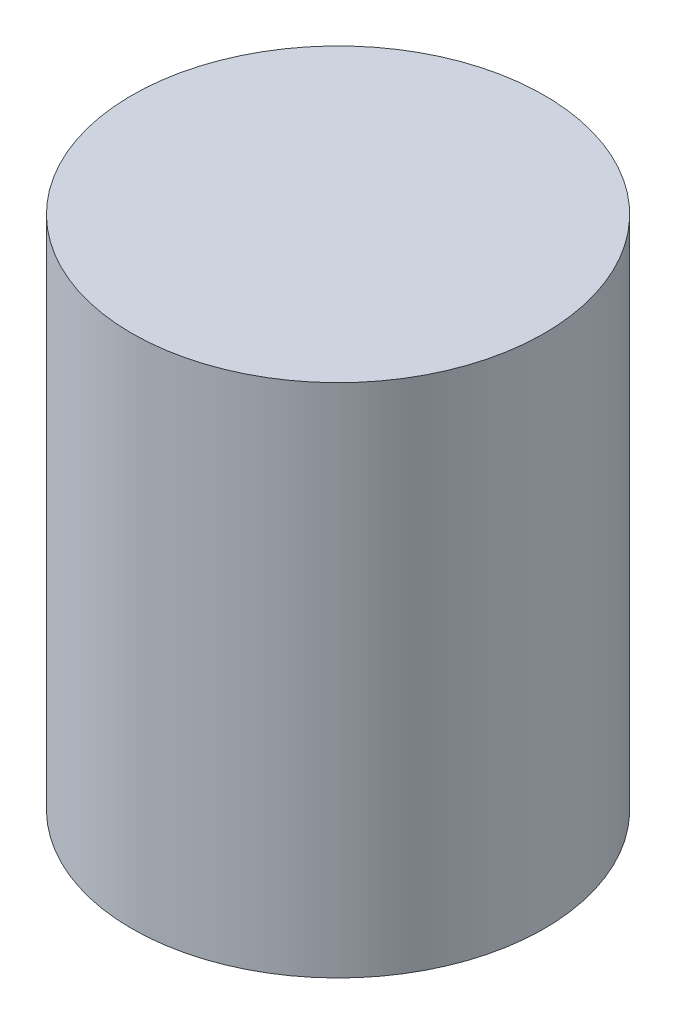
ISO-10303-21;
HEADER;
FILE_DESCRIPTION(('STEP AP214'),'2;1');
FILE_NAME('part.step','',(''),(''),'','','');
FILE_SCHEMA(('AUTOMOTIVE_DESIGN { 1 0 10303 214 1 1 1 1 }'));
ENDSEC;
DATA;
#1=APPLICATION_CONTEXT('core data for automotive mechanical design processes');
#2=APPLICATION_PROTOCOL_DEFINITION('international standard','automotive_design',2000,#1);
#3=PRODUCT_CONTEXT('',#1,'mechanical');
#4=PRODUCT('Part','Part','',(#3));
#5=PRODUCT_RELATED_PRODUCT_CATEGORY('part','',(#4));
#6=PRODUCT_DEFINITION_FORMATION('','',#4);
#7=PRODUCT_DEFINITION_CONTEXT('part definition',#1,'design');
#8=PRODUCT_DEFINITION('design','',#6,#7);
#9=PRODUCT_DEFINITION_SHAPE('','',#8);
#10=(LENGTH_UNIT() NAMED_UNIT(*) SI_UNIT(.MILLI.,.METRE.));
#11=(NAMED_UNIT(*) PLANE_ANGLE_UNIT() SI_UNIT($,.RADIAN.));
#12=(NAMED_UNIT(*) SI_UNIT($,.STERADIAN.) SOLID_ANGLE_UNIT());
#13=UNCERTAINTY_MEASURE_WITH_UNIT(LENGTH_MEASURE(1.E-05),#10,'distance_accuracy_value','');
#14=(GEOMETRIC_REPRESENTATION_CONTEXT(3) GLOBAL_UNCERTAINTY_ASSIGNED_CONTEXT((#13)) GLOBAL_UNIT_ASSIGNED_CONTEXT((#10,
#11,#12)) REPRESENTATION_CONTEXT('',''));
#15=CARTESIAN_POINT('',(0.,0.,0.));
#16=DIRECTION('',(0.,0.,1.));
#17=DIRECTION('',(1.,0.,0.));
#18=AXIS2_PLACEMENT_3D('',#15,#16,#17);
#19=CARTESIAN_POINT('',(0.,5.,0.));
#20=DIRECTION('',(0.,-1.,0.));
#21=DIRECTION('',(0.,0.,-1.));
#22=AXIS2_PLACEMENT_3D('',#19,#20,#21);
#23=CYLINDRICAL_SURFACE('',#22,4.);
#24=CARTESIAN_POINT('',(0.,5.,0.));
#25=DIRECTION('',(0.,1.,0.));
#26=DIRECTION('',(0.,0.,1.));
#27=AXIS2_PLACEMENT_3D('',#24,#25,#26);
#28=CIRCLE('',#27,4.);
#29=CARTESIAN_POINT('',(0.,5.,4.));
#30=VERTEX_POINT('',#29);
#31=EDGE_CURVE('E10',#30,#30,#28,.T.);
#32=ORIENTED_EDGE('',*,*,#31,.F.);
#33=EDGE_LOOP('',(#32));
#34=FACE_BOUND('',#33,.T.);
#35=CARTESIAN_POINT('',(0.,-5.,0.));
#36=DIRECTION('',(0.,1.,0.));
#37=DIRECTION('',(0.,0.,1.));
#38=AXIS2_PLACEMENT_3D('',#35,#36,#37);
#39=CIRCLE('',#38,4.);
#40=CARTESIAN_POINT('',(0.,-5.,4.));
#41=VERTEX_POINT('',#40);
#42=EDGE_CURVE('E40',#41,#41,#39,.T.);
#43=ORIENTED_EDGE('',*,*,#42,.T.);
#44=EDGE_LOOP('',(#43));
#45=FACE_BOUND('',#44,.T.);
#46=ADVANCED_FACE('F37',(#34,#45),#23,.T.);
#47=CARTESIAN_POINT('',(0.,5.,0.));
#48=DIRECTION('',(0.,1.,0.));
#49=DIRECTION('',(0.,0.,1.));
#50=AXIS2_PLACEMENT_3D('',#47,#48,#49);
#51=PLANE('',#50);
#52=ORIENTED_EDGE('',*,*,#31,.T.);
#53=EDGE_LOOP('',(#52));
#54=FACE_BOUND('',#53,.T.);
#55=ADVANCED_FACE('F52',(#54),#51,.T.);
#56=CARTESIAN_POINT('',(0.,-5.,0.));
#57=DIRECTION('',(0.,1.,0.));
#58=DIRECTION('',(0.,0.,1.));
#59=AXIS2_PLACEMENT_3D('',#56,#57,#58);
#60=PLANE('',#59);
#61=ORIENTED_EDGE('',*,*,#42,.F.);
#62=EDGE_LOOP('',(#61));
#63=FACE_BOUND('',#62,.T.);
#64=ADVANCED_FACE('F50',(#63),#60,.F.);
#65=CLOSED_SHELL('',(#46,#55,#64));
#66=MANIFOLD_SOLID_BREP('B2',#65);
#67=ADVANCED_BREP_SHAPE_REPRESENTATION('',(#18,#66),#14);
#68=SHAPE_DEFINITION_REPRESENTATION(#9,#67);
ENDSEC;
END-ISO-10303-21;
